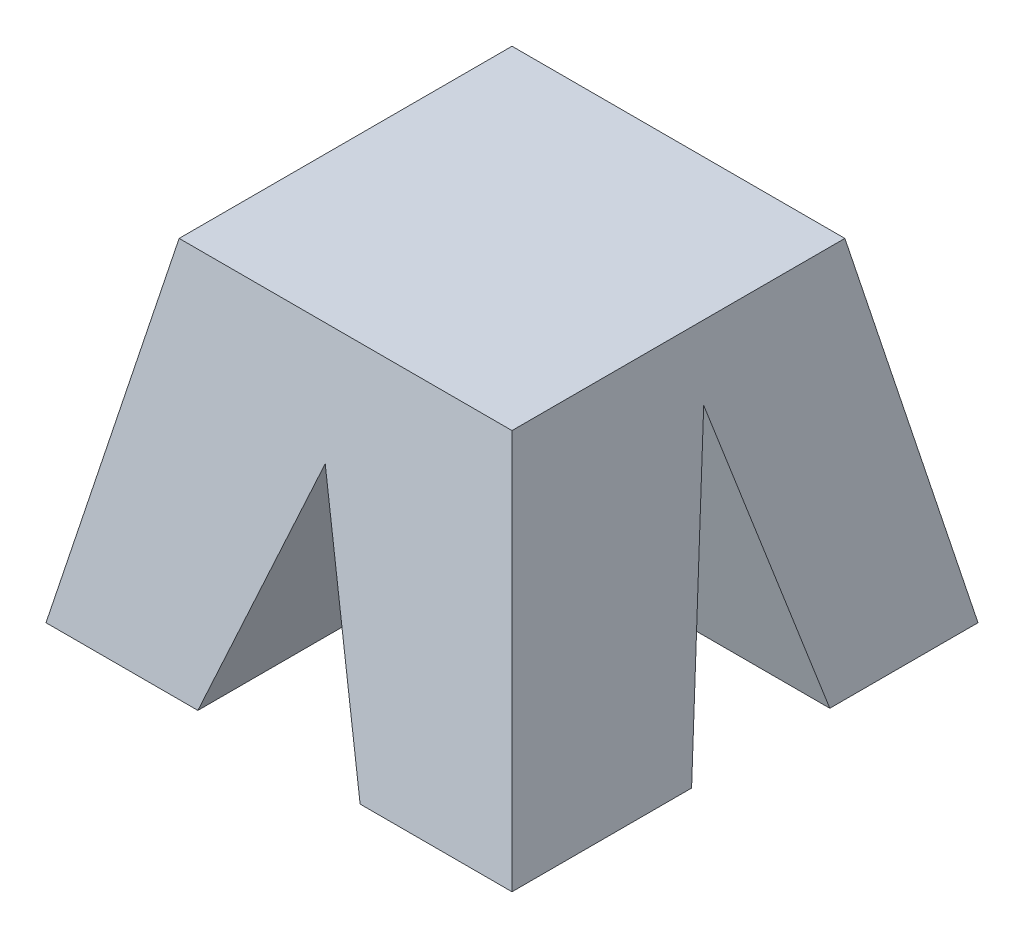
ISO-10303-21;
HEADER;
FILE_DESCRIPTION(('STEP AP214'),'2;1');
FILE_NAME('part.step','',(''),(''),'','','');
FILE_SCHEMA(('AUTOMOTIVE_DESIGN { 1 0 10303 214 1 1 1 1 }'));
ENDSEC;
DATA;
#1=APPLICATION_CONTEXT('core data for automotive mechanical design processes');
#2=APPLICATION_PROTOCOL_DEFINITION('international standard','automotive_design',2000,#1);
#3=PRODUCT_CONTEXT('',#1,'mechanical');
#4=PRODUCT('Part','Part','',(#3));
#5=PRODUCT_RELATED_PRODUCT_CATEGORY('part','',(#4));
#6=PRODUCT_DEFINITION_FORMATION('','',#4);
#7=PRODUCT_DEFINITION_CONTEXT('part definition',#1,'design');
#8=PRODUCT_DEFINITION('design','',#6,#7);
#9=PRODUCT_DEFINITION_SHAPE('','',#8);
#10=(LENGTH_UNIT() NAMED_UNIT(*) SI_UNIT(.MILLI.,.METRE.));
#11=(NAMED_UNIT(*) PLANE_ANGLE_UNIT() SI_UNIT($,.RADIAN.));
#12=(NAMED_UNIT(*) SI_UNIT($,.STERADIAN.) SOLID_ANGLE_UNIT());
#13=UNCERTAINTY_MEASURE_WITH_UNIT(LENGTH_MEASURE(1.E-05),#10,'distance_accuracy_value','');
#14=(GEOMETRIC_REPRESENTATION_CONTEXT(3) GLOBAL_UNCERTAINTY_ASSIGNED_CONTEXT((#13)) GLOBAL_UNIT_ASSIGNED_CONTEXT((#10,
#11,#12)) REPRESENTATION_CONTEXT('',''));
#15=CARTESIAN_POINT('',(0.,0.,0.));
#16=DIRECTION('',(0.,0.,1.));
#17=DIRECTION('',(1.,0.,0.));
#18=AXIS2_PLACEMENT_3D('',#15,#16,#17);
#19=CARTESIAN_POINT('',(0.,-5.,0.));
#20=DIRECTION('',(0.,-1.,0.));
#21=DIRECTION('',(0.,0.,-1.));
#22=AXIS2_PLACEMENT_3D('',#19,#20,#21);
#23=PLANE('',#22);
#24=DIRECTION('',(0.,0.,1.));
#25=VECTOR('',#24,1.);
#26=CARTESIAN_POINT('',(0.487414429426886,-5.,0.));
#27=LINE('',#26,#25);
#28=CARTESIAN_POINT('',(0.487414429426886,-5.,1.32095885605147));
#29=VERTEX_POINT('',#28);
#30=CARTESIAN_POINT('',(0.487414429426886,-5.,2.4));
#31=VERTEX_POINT('',#30);
#32=EDGE_CURVE('E165',#29,#31,#27,.T.);
#33=ORIENTED_EDGE('',*,*,#32,.F.);
#34=DIRECTION('',(-1.,0.,0.));
#35=VECTOR('',#34,1.);
#36=CARTESIAN_POINT('',(0.,-5.,1.32095885605147));
#37=LINE('',#36,#35);
#38=CARTESIAN_POINT('',(1.4,-5.,1.32095885605147));
#39=VERTEX_POINT('',#38);
#40=EDGE_CURVE('E205',#39,#29,#37,.T.);
#41=ORIENTED_EDGE('',*,*,#40,.F.);
#42=DIRECTION('',(0.,0.,1.));
#43=VECTOR('',#42,1.);
#44=CARTESIAN_POINT('',(1.4,-5.,-0.4));
#45=LINE('',#44,#43);
#46=CARTESIAN_POINT('',(1.4,-5.,2.4));
#47=VERTEX_POINT('',#46);
#48=EDGE_CURVE('E288',#39,#47,#45,.T.);
#49=ORIENTED_EDGE('',*,*,#48,.T.);
#50=DIRECTION('',(-1.,0.,0.));
#51=VECTOR('',#50,1.);
#52=CARTESIAN_POINT('',(1.4,-5.,2.4));
#53=LINE('',#52,#51);
#54=EDGE_CURVE('E302',#47,#31,#53,.T.);
#55=ORIENTED_EDGE('',*,*,#54,.T.);
#56=EDGE_LOOP('',(#33,#41,#49,#55));
#57=FACE_BOUND('',#56,.T.);
#58=ADVANCED_FACE('F42',(#57),#23,.T.);
#59=DIRECTION('',(0.,0.,1.));
#60=VECTOR('',#59,1.);
#61=CARTESIAN_POINT('',(0.487414429426886,-5.,0.));
#62=LINE('',#61,#60);
#63=CARTESIAN_POINT('',(0.487414429426886,-5.,-0.4));
#64=VERTEX_POINT('',#63);
#65=CARTESIAN_POINT('',(0.487414429426886,-5.,0.490309637659192));
#66=VERTEX_POINT('',#65);
#67=EDGE_CURVE('E162',#64,#66,#62,.T.);
#68=ORIENTED_EDGE('',*,*,#67,.F.);
#69=DIRECTION('',(1.,0.,0.));
#70=VECTOR('',#69,1.);
#71=CARTESIAN_POINT('',(1.4,-5.,-0.4));
#72=LINE('',#71,#70);
#73=CARTESIAN_POINT('',(1.4,-5.,-0.4));
#74=VERTEX_POINT('',#73);
#75=EDGE_CURVE('E159',#64,#74,#72,.T.);
#76=ORIENTED_EDGE('',*,*,#75,.T.);
#77=CARTESIAN_POINT('',(1.4,-5.,0.490309637659191));
#78=VERTEX_POINT('',#77);
#79=EDGE_CURVE('E285',#74,#78,#45,.T.);
#80=ORIENTED_EDGE('',*,*,#79,.T.);
#81=DIRECTION('',(1.,0.,0.));
#82=VECTOR('',#81,1.);
#83=CARTESIAN_POINT('',(0.,-5.,0.490309637659192));
#84=LINE('',#83,#82);
#85=EDGE_CURVE('E185',#66,#78,#84,.T.);
#86=ORIENTED_EDGE('',*,*,#85,.F.);
#87=EDGE_LOOP('',(#68,#76,#80,#86));
#88=FACE_BOUND('',#87,.T.);
#89=ADVANCED_FACE('F470',(#88),#23,.T.);
#90=DIRECTION('',(0.,0.,-1.));
#91=VECTOR('',#90,1.);
#92=CARTESIAN_POINT('',(-0.487414429426885,-5.,0.));
#93=LINE('',#92,#91);
#94=CARTESIAN_POINT('',(-0.487414429426885,-5.,2.4));
#95=VERTEX_POINT('',#94);
#96=CARTESIAN_POINT('',(-0.487414429426885,-5.,1.32095885605147));
#97=VERTEX_POINT('',#96);
#98=EDGE_CURVE('E61',#95,#97,#93,.T.);
#99=ORIENTED_EDGE('',*,*,#98,.F.);
#100=CARTESIAN_POINT('',(-1.4,-5.,2.4));
#101=VERTEX_POINT('',#100);
#102=EDGE_CURVE('E47',#95,#101,#53,.T.);
#103=ORIENTED_EDGE('',*,*,#102,.T.);
#104=DIRECTION('',(0.,0.,-1.));
#105=VECTOR('',#104,1.);
#106=CARTESIAN_POINT('',(-1.4,-5.,-0.4));
#107=LINE('',#106,#105);
#108=CARTESIAN_POINT('',(-1.4,-5.,1.32095885605147));
#109=VERTEX_POINT('',#108);
#110=EDGE_CURVE('E290',#101,#109,#107,.T.);
#111=ORIENTED_EDGE('',*,*,#110,.T.);
#112=EDGE_CURVE('E202',#97,#109,#37,.T.);
#113=ORIENTED_EDGE('',*,*,#112,.F.);
#114=EDGE_LOOP('',(#99,#103,#111,#113));
#115=FACE_BOUND('',#114,.T.);
#116=ADVANCED_FACE('F468',(#115),#23,.T.);
#117=DIRECTION('',(0.,0.,-1.));
#118=VECTOR('',#117,1.);
#119=CARTESIAN_POINT('',(-0.487414429426885,-5.,0.));
#120=LINE('',#119,#118);
#121=CARTESIAN_POINT('',(-0.487414429426885,-5.,0.490309637659192));
#122=VERTEX_POINT('',#121);
#123=CARTESIAN_POINT('',(-0.487414429426885,-5.,-0.4));
#124=VERTEX_POINT('',#123);
#125=EDGE_CURVE('E142',#122,#124,#120,.T.);
#126=ORIENTED_EDGE('',*,*,#125,.F.);
#127=CARTESIAN_POINT('',(-1.4,-5.,0.490309637659191));
#128=VERTEX_POINT('',#127);
#129=EDGE_CURVE('E186',#128,#122,#84,.T.);
#130=ORIENTED_EDGE('',*,*,#129,.F.);
#131=CARTESIAN_POINT('',(-1.4,-5.,-0.4));
#132=VERTEX_POINT('',#131);
#133=EDGE_CURVE('E197',#128,#132,#107,.T.);
#134=ORIENTED_EDGE('',*,*,#133,.T.);
#135=EDGE_CURVE('E300',#132,#124,#72,.T.);
#136=ORIENTED_EDGE('',*,*,#135,.T.);
#137=EDGE_LOOP('',(#126,#130,#134,#136));
#138=FACE_BOUND('',#137,.T.);
#139=ADVANCED_FACE('F44',(#138),#23,.T.);
#140=CARTESIAN_POINT('',(0.,-3.,0.));
#141=DIRECTION('',(0.,-1.,0.));
#142=DIRECTION('',(0.,0.,-1.));
#143=AXIS2_PLACEMENT_3D('',#140,#141,#142);
#144=PLANE('',#143);
#145=DIRECTION('',(0.,0.,-1.));
#146=VECTOR('',#145,1.);
#147=CARTESIAN_POINT('',(-1.,-3.,2.));
#148=LINE('',#147,#146);
#149=CARTESIAN_POINT('',(-1.,-3.,2.));
#150=VERTEX_POINT('',#149);
#151=CARTESIAN_POINT('',(-1.,-3.,0.));
#152=VERTEX_POINT('',#151);
#153=EDGE_CURVE('E215',#150,#152,#148,.T.);
#154=ORIENTED_EDGE('',*,*,#153,.F.);
#155=DIRECTION('',(-1.,0.,0.));
#156=VECTOR('',#155,1.);
#157=CARTESIAN_POINT('',(-1.,-3.,2.));
#158=LINE('',#157,#156);
#159=CARTESIAN_POINT('',(1.,-3.,2.));
#160=VERTEX_POINT('',#159);
#161=EDGE_CURVE('E223',#160,#150,#158,.T.);
#162=ORIENTED_EDGE('',*,*,#161,.F.);
#163=DIRECTION('',(0.,0.,1.));
#164=VECTOR('',#163,1.);
#165=CARTESIAN_POINT('',(1.,-3.,2.));
#166=LINE('',#165,#164);
#167=CARTESIAN_POINT('',(1.,-3.,0.));
#168=VERTEX_POINT('',#167);
#169=EDGE_CURVE('E388',#168,#160,#166,.T.);
#170=ORIENTED_EDGE('',*,*,#169,.F.);
#171=DIRECTION('',(1.,0.,0.));
#172=VECTOR('',#171,1.);
#173=CARTESIAN_POINT('',(-1.,-3.,0.));
#174=LINE('',#173,#172);
#175=EDGE_CURVE('E398',#152,#168,#174,.T.);
#176=ORIENTED_EDGE('',*,*,#175,.F.);
#177=EDGE_LOOP('',(#154,#162,#170,#176));
#178=FACE_BOUND('',#177,.T.);
#179=ADVANCED_FACE('F365',(#178),#144,.F.);
#180=CARTESIAN_POINT('',(0.,-0.115384615384615,0.576923076923077));
#181=DIRECTION('',(0.,-0.196116135138184,0.98058067569092));
#182=DIRECTION('',(0.,-0.98058067569092,-0.196116135138184));
#183=AXIS2_PLACEMENT_3D('',#180,#181,#182);
#184=PLANE('',#183);
#185=ORIENTED_EDGE('',*,*,#75,.F.);
#186=DIRECTION('',(-0.325479744786791,0.927187089935885,0.185437417987177));
#187=VECTOR('',#186,1.);
#188=CARTESIAN_POINT('',(-1.09726636070957,-0.485754201858567,0.502849159628287));
#189=LINE('',#188,#187);
#190=CARTESIAN_POINT('',(0.,-3.61151308598601,-0.122302617197201));
#191=VERTEX_POINT('',#190);
#192=EDGE_CURVE('E151',#64,#191,#189,.T.);
#193=ORIENTED_EDGE('',*,*,#192,.T.);
#194=DIRECTION('',(-0.32547974478679,-0.927187089935885,-0.185437417987177));
#195=VECTOR('',#194,1.);
#196=CARTESIAN_POINT('',(1.09726636070957,-0.485754201858565,0.502849159628287));
#197=LINE('',#196,#195);
#198=EDGE_CURVE('E139',#191,#124,#197,.T.);
#199=ORIENTED_EDGE('',*,*,#198,.T.);
#200=ORIENTED_EDGE('',*,*,#135,.F.);
#201=DIRECTION('',(-0.192450089729875,-0.962250448649376,-0.192450089729875));
#202=VECTOR('',#201,1.);
#203=CARTESIAN_POINT('',(-1.,-3.,0.));
#204=LINE('',#203,#202);
#205=EDGE_CURVE('E384',#152,#132,#204,.T.);
#206=ORIENTED_EDGE('',*,*,#205,.F.);
#207=ORIENTED_EDGE('',*,*,#175,.T.);
#208=DIRECTION('',(0.192450089729875,-0.962250448649376,-0.192450089729875));
#209=VECTOR('',#208,1.);
#210=CARTESIAN_POINT('',(1.,-3.,0.));
#211=LINE('',#210,#209);
#212=EDGE_CURVE('E377',#168,#74,#211,.T.);
#213=ORIENTED_EDGE('',*,*,#212,.T.);
#214=EDGE_LOOP('',(#185,#193,#199,#200,#206,#207,#213));
#215=FACE_BOUND('',#214,.T.);
#216=ADVANCED_FACE('F157',(#215),#184,.F.);
#217=CARTESIAN_POINT('',(-0.384615384615385,0.0769230769230769,0.));
#218=DIRECTION('',(0.98058067569092,-0.196116135138184,0.));
#219=DIRECTION('',(0.196116135138184,0.98058067569092,0.));
#220=AXIS2_PLACEMENT_3D('',#217,#218,#219);
#221=PLANE('',#220);
#222=DIRECTION('',(0.189806623788741,0.949033118943708,0.251613959695995));
#223=VECTOR('',#222,1.);
#224=CARTESIAN_POINT('',(-0.47231516874654,-0.361575843732697,1.72007943748132));
#225=LINE('',#224,#223);
#226=CARTESIAN_POINT('',(-1.07410829607963,-3.37054148039817,0.922322495897188));
#227=VERTEX_POINT('',#226);
#228=EDGE_CURVE('E189',#128,#227,#225,.T.);
#229=ORIENTED_EDGE('',*,*,#228,.T.);
#230=DIRECTION('',(-0.190705484571187,-0.953527422855936,0.233274242076114));
#231=VECTOR('',#230,1.);
#232=CARTESIAN_POINT('',(-0.38110436882567,0.0944781558716519,0.0746281243931838));
#233=LINE('',#232,#231);
#234=EDGE_CURVE('E211',#227,#109,#233,.T.);
#235=ORIENTED_EDGE('',*,*,#234,.T.);
#236=ORIENTED_EDGE('',*,*,#110,.F.);
#237=DIRECTION('',(-0.192450089729875,-0.962250448649376,0.192450089729875));
#238=VECTOR('',#237,1.);
#239=CARTESIAN_POINT('',(-1.,-3.,2.));
#240=LINE('',#239,#238);
#241=EDGE_CURVE('E289',#150,#101,#240,.T.);
#242=ORIENTED_EDGE('',*,*,#241,.F.);
#243=ORIENTED_EDGE('',*,*,#153,.T.);
#244=ORIENTED_EDGE('',*,*,#205,.T.);
#245=ORIENTED_EDGE('',*,*,#133,.F.);
#246=EDGE_LOOP('',(#229,#235,#236,#242,#243,#244,#245));
#247=FACE_BOUND('',#246,.T.);
#248=ADVANCED_FACE('F364',(#247),#221,.F.);
#249=CARTESIAN_POINT('',(0.384615384615385,0.076923076923077,0.));
#250=DIRECTION('',(-0.98058067569092,-0.196116135138184,0.));
#251=DIRECTION('',(0.196116135138184,-0.98058067569092,0.));
#252=AXIS2_PLACEMENT_3D('',#249,#250,#251);
#253=PLANE('',#252);
#254=ORIENTED_EDGE('',*,*,#48,.F.);
#255=DIRECTION('',(-0.190705484571187,0.953527422855936,-0.233274242076114));
#256=VECTOR('',#255,1.);
#257=CARTESIAN_POINT('',(0.38110436882567,0.094478155871652,0.0746281243931838));
#258=LINE('',#257,#256);
#259=CARTESIAN_POINT('',(1.07410829607963,-3.37054148039817,0.922322495897188));
#260=VERTEX_POINT('',#259);
#261=EDGE_CURVE('E200',#39,#260,#258,.T.);
#262=ORIENTED_EDGE('',*,*,#261,.T.);
#263=DIRECTION('',(0.189806623788741,-0.949033118943708,-0.251613959695995));
#264=VECTOR('',#263,1.);
#265=CARTESIAN_POINT('',(0.47231516874654,-0.361575843732697,1.72007943748132));
#266=LINE('',#265,#264);
#267=EDGE_CURVE('E338',#260,#78,#266,.T.);
#268=ORIENTED_EDGE('',*,*,#267,.T.);
#269=ORIENTED_EDGE('',*,*,#79,.F.);
#270=ORIENTED_EDGE('',*,*,#212,.F.);
#271=ORIENTED_EDGE('',*,*,#169,.T.);
#272=DIRECTION('',(0.192450089729875,-0.962250448649376,0.192450089729875));
#273=VECTOR('',#272,1.);
#274=CARTESIAN_POINT('',(1.,-3.,2.));
#275=LINE('',#274,#273);
#276=EDGE_CURVE('E228',#160,#47,#275,.T.);
#277=ORIENTED_EDGE('',*,*,#276,.T.);
#278=EDGE_LOOP('',(#254,#262,#268,#269,#270,#271,#277));
#279=FACE_BOUND('',#278,.T.);
#280=ADVANCED_FACE('F240',(#279),#253,.F.);
#281=CARTESIAN_POINT('',(0.,0.269230769230769,1.34615384615385));
#282=DIRECTION('',(0.,-0.196116135138184,-0.98058067569092));
#283=DIRECTION('',(0.,0.98058067569092,-0.196116135138184));
#284=AXIS2_PLACEMENT_3D('',#281,#282,#283);
#285=PLANE('',#284);
#286=DIRECTION('',(0.32547974478679,0.927187089935885,-0.185437417987177));
#287=VECTOR('',#286,1.);
#288=CARTESIAN_POINT('',(1.21797860767034,-0.141883841961055,1.42837676839221));
#289=LINE('',#288,#287);
#290=CARTESIAN_POINT('',(0.,-3.61151308598601,2.1223026171972));
#291=VERTEX_POINT('',#290);
#292=EDGE_CURVE('E167',#95,#291,#289,.T.);
#293=ORIENTED_EDGE('',*,*,#292,.T.);
#294=DIRECTION('',(0.325479744786791,-0.927187089935885,0.185437417987177));
#295=VECTOR('',#294,1.);
#296=CARTESIAN_POINT('',(-1.21797860767034,-0.141883841961057,1.42837676839221));
#297=LINE('',#296,#295);
#298=EDGE_CURVE('E175',#291,#31,#297,.T.);
#299=ORIENTED_EDGE('',*,*,#298,.T.);
#300=ORIENTED_EDGE('',*,*,#54,.F.);
#301=ORIENTED_EDGE('',*,*,#276,.F.);
#302=ORIENTED_EDGE('',*,*,#161,.T.);
#303=ORIENTED_EDGE('',*,*,#241,.T.);
#304=ORIENTED_EDGE('',*,*,#102,.F.);
#305=EDGE_LOOP('',(#293,#299,#300,#301,#302,#303,#304));
#306=FACE_BOUND('',#305,.T.);
#307=ADVANCED_FACE('F230',(#306),#285,.F.);
#308=CARTESIAN_POINT('',(-1.4,-3.37054148039817,0.922322495897188));
#309=DIRECTION('',(0.,0.237635495450179,0.971354400464706));
#310=DIRECTION('',(0.,-0.971354400464706,0.237635495450179));
#311=AXIS2_PLACEMENT_3D('',#308,#309,#310);
#312=PLANE('',#311);
#313=ORIENTED_EDGE('',*,*,#40,.T.);
#314=DIRECTION('',(-0.322737646496548,0.91937573400738,-0.224919254961108));
#315=VECTOR('',#314,1.);
#316=CARTESIAN_POINT('',(-0.22160316402761,-2.98023695877281,0.826837049670235));
#317=LINE('',#316,#315);
#318=CARTESIAN_POINT('',(0.,-3.61151308598601,0.981274621769984));
#319=VERTEX_POINT('',#318);
#320=EDGE_CURVE('E161',#29,#319,#317,.T.);
#321=ORIENTED_EDGE('',*,*,#320,.T.);
#322=DIRECTION('',(-0.322737646496547,-0.91937573400738,0.224919254961108));
#323=VECTOR('',#322,1.);
#324=CARTESIAN_POINT('',(-0.0700436836775563,-3.81104500856363,1.03008880046437));
#325=LINE('',#324,#323);
#326=EDGE_CURVE('E147',#319,#97,#325,.T.);
#327=ORIENTED_EDGE('',*,*,#326,.T.);
#328=ORIENTED_EDGE('',*,*,#112,.T.);
#329=ORIENTED_EDGE('',*,*,#234,.F.);
#330=DIRECTION('',(1.,0.,0.));
#331=VECTOR('',#330,1.);
#332=CARTESIAN_POINT('',(-1.4,-3.37054148039817,0.922322495897188));
#333=LINE('',#332,#331);
#334=EDGE_CURVE('E180',#227,#260,#333,.T.);
#335=ORIENTED_EDGE('',*,*,#334,.T.);
#336=ORIENTED_EDGE('',*,*,#261,.F.);
#337=EDGE_LOOP('',(#313,#321,#327,#328,#329,#335,#336));
#338=FACE_BOUND('',#337,.T.);
#339=ADVANCED_FACE('F239',(#338),#312,.F.);
#340=CARTESIAN_POINT('',(-1.4,-5.35890374703274,0.395154694024402));
#341=DIRECTION('',(0.,0.256272612996124,-0.966604545731158));
#342=DIRECTION('',(0.,0.966604545731158,0.256272612996124));
#343=AXIS2_PLACEMENT_3D('',#340,#341,#342);
#344=PLANE('',#343);
#345=DIRECTION('',(0.321322783764168,0.91534524522734,0.242682407013252));
#346=VECTOR('',#345,1.);
#347=CARTESIAN_POINT('',(-0.694618721253222,-5.59025837225765,0.333816420169834));
#348=LINE('',#347,#346);
#349=CARTESIAN_POINT('',(0.,-3.61151308598601,0.858434504376153));
#350=VERTEX_POINT('',#349);
#351=EDGE_CURVE('E53',#122,#350,#348,.T.);
#352=ORIENTED_EDGE('',*,*,#351,.T.);
#353=DIRECTION('',(0.321322783764169,-0.91534524522734,-0.242682407013252));
#354=VECTOR('',#353,1.);
#355=CARTESIAN_POINT('',(0.40552339342855,-4.76671878181277,0.552158702627679));
#356=LINE('',#355,#354);
#357=EDGE_CURVE('E12',#350,#66,#356,.T.);
#358=ORIENTED_EDGE('',*,*,#357,.T.);
#359=ORIENTED_EDGE('',*,*,#85,.T.);
#360=ORIENTED_EDGE('',*,*,#267,.F.);
#361=ORIENTED_EDGE('',*,*,#334,.F.);
#362=ORIENTED_EDGE('',*,*,#228,.F.);
#363=ORIENTED_EDGE('',*,*,#129,.T.);
#364=EDGE_LOOP('',(#352,#358,#359,#360,#361,#362,#363));
#365=FACE_BOUND('',#364,.T.);
#366=ADVANCED_FACE('F479',(#365),#344,.F.);
#367=CARTESIAN_POINT('',(0.,-3.61151308598601,-0.4));
#368=DIRECTION('',(-0.943551983681825,0.33122447688855,0.));
#369=DIRECTION('',(-0.33122447688855,-0.943551983681825,0.));
#370=AXIS2_PLACEMENT_3D('',#367,#368,#369);
#371=PLANE('',#370);
#372=DIRECTION('',(0.,0.,1.));
#373=VECTOR('',#372,1.);
#374=CARTESIAN_POINT('',(0.,-3.61151308598601,-0.4));
#375=LINE('',#374,#373);
#376=EDGE_CURVE('E69',#191,#350,#375,.T.);
#377=ORIENTED_EDGE('',*,*,#376,.T.);
#378=ORIENTED_EDGE('',*,*,#351,.F.);
#379=ORIENTED_EDGE('',*,*,#125,.T.);
#380=ORIENTED_EDGE('',*,*,#198,.F.);
#381=EDGE_LOOP('',(#377,#378,#379,#380));
#382=FACE_BOUND('',#381,.T.);
#383=ADVANCED_FACE('F140',(#382),#371,.F.);
#384=CARTESIAN_POINT('',(0.500000000000001,-5.03585224193448,-0.4));
#385=DIRECTION('',(0.943551983681825,0.331224476888551,0.));
#386=DIRECTION('',(-0.331224476888551,0.943551983681825,0.));
#387=AXIS2_PLACEMENT_3D('',#384,#385,#386);
#388=PLANE('',#387);
#389=ORIENTED_EDGE('',*,*,#67,.T.);
#390=ORIENTED_EDGE('',*,*,#357,.F.);
#391=ORIENTED_EDGE('',*,*,#376,.F.);
#392=ORIENTED_EDGE('',*,*,#192,.F.);
#393=EDGE_LOOP('',(#389,#390,#391,#392));
#394=FACE_BOUND('',#393,.T.);
#395=ADVANCED_FACE('F150',(#394),#388,.F.);
#396=EDGE_CURVE('E154',#319,#291,#375,.T.);
#397=ORIENTED_EDGE('',*,*,#396,.F.);
#398=ORIENTED_EDGE('',*,*,#320,.F.);
#399=ORIENTED_EDGE('',*,*,#32,.T.);
#400=ORIENTED_EDGE('',*,*,#298,.F.);
#401=EDGE_LOOP('',(#397,#398,#399,#400));
#402=FACE_BOUND('',#401,.T.);
#403=ADVANCED_FACE('F497',(#402),#388,.F.);
#404=ORIENTED_EDGE('',*,*,#98,.T.);
#405=ORIENTED_EDGE('',*,*,#326,.F.);
#406=ORIENTED_EDGE('',*,*,#396,.T.);
#407=ORIENTED_EDGE('',*,*,#292,.F.);
#408=EDGE_LOOP('',(#404,#405,#406,#407));
#409=FACE_BOUND('',#408,.T.);
#410=ADVANCED_FACE('F496',(#409),#371,.F.);
#411=CLOSED_SHELL('',(#58,#89,#116,#139,#179,#216,#248,#280,#307,#339,#366,#383,#395,#403,#410));
#412=MANIFOLD_SOLID_BREP('B2',#411);
#413=ADVANCED_BREP_SHAPE_REPRESENTATION('',(#18,#412),#14);
#414=SHAPE_DEFINITION_REPRESENTATION(#9,#413);
ENDSEC;
END-ISO-10303-21;
